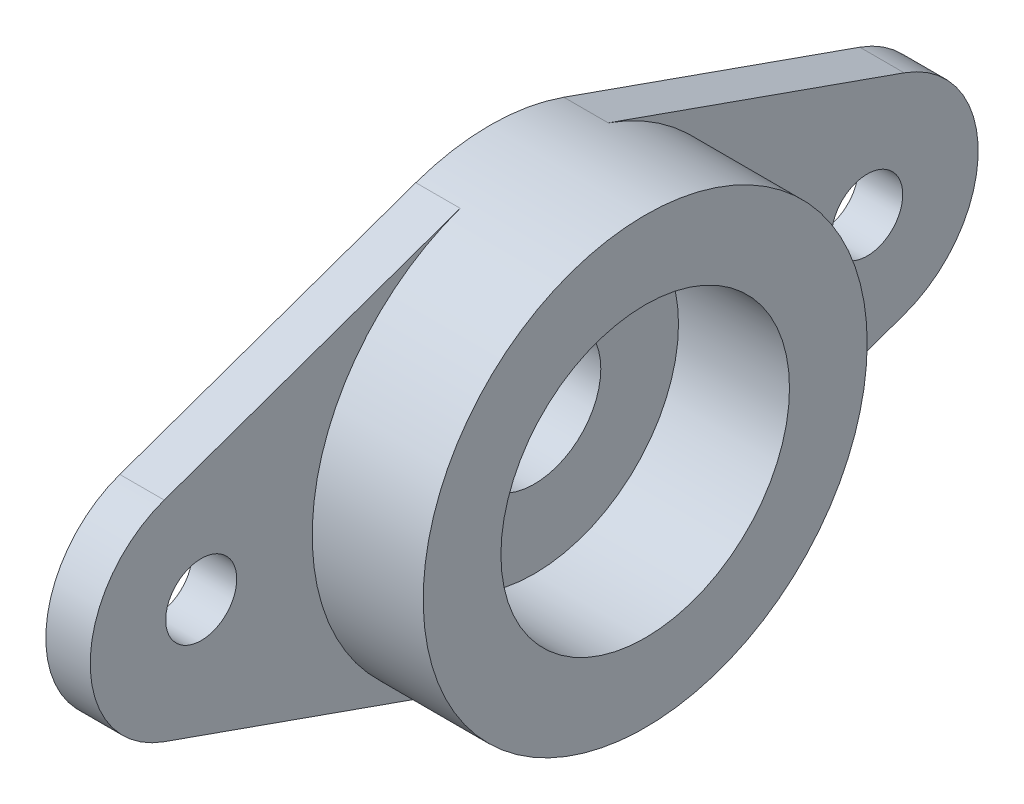
ISO-10303-21;
HEADER;
FILE_DESCRIPTION(('STEP AP214'),'2;1');
FILE_NAME('part.step','',(''),(''),'','','');
FILE_SCHEMA(('AUTOMOTIVE_DESIGN { 1 0 10303 214 1 1 1 1 }'));
ENDSEC;
DATA;
#1=APPLICATION_CONTEXT('core data for automotive mechanical design processes');
#2=APPLICATION_PROTOCOL_DEFINITION('international standard','automotive_design',2000,#1);
#3=PRODUCT_CONTEXT('',#1,'mechanical');
#4=PRODUCT('Part','Part','',(#3));
#5=PRODUCT_RELATED_PRODUCT_CATEGORY('part','',(#4));
#6=PRODUCT_DEFINITION_FORMATION('','',#4);
#7=PRODUCT_DEFINITION_CONTEXT('part definition',#1,'design');
#8=PRODUCT_DEFINITION('design','',#6,#7);
#9=PRODUCT_DEFINITION_SHAPE('','',#8);
#10=(LENGTH_UNIT() NAMED_UNIT(*) SI_UNIT(.MILLI.,.METRE.));
#11=(NAMED_UNIT(*) PLANE_ANGLE_UNIT() SI_UNIT($,.RADIAN.));
#12=(NAMED_UNIT(*) SI_UNIT($,.STERADIAN.) SOLID_ANGLE_UNIT());
#13=UNCERTAINTY_MEASURE_WITH_UNIT(LENGTH_MEASURE(1.E-05),#10,'distance_accuracy_value','');
#14=(GEOMETRIC_REPRESENTATION_CONTEXT(3) GLOBAL_UNCERTAINTY_ASSIGNED_CONTEXT((#13)) GLOBAL_UNIT_ASSIGNED_CONTEXT((#10,
#11,#12)) REPRESENTATION_CONTEXT('',''));
#15=CARTESIAN_POINT('',(0.,0.,0.));
#16=DIRECTION('',(0.,0.,1.));
#17=DIRECTION('',(1.,0.,0.));
#18=AXIS2_PLACEMENT_3D('',#15,#16,#17);
#19=CARTESIAN_POINT('',(40.2842712474619,0.,0.));
#20=DIRECTION('',(-1.,0.,0.));
#21=DIRECTION('',(0.,0.,1.));
#22=AXIS2_PLACEMENT_3D('',#19,#20,#21);
#23=CYLINDRICAL_SURFACE('',#22,10.);
#24=CARTESIAN_POINT('',(7.,0.,0.));
#25=DIRECTION('',(1.,0.,0.));
#26=DIRECTION('',(0.,0.,-1.));
#27=AXIS2_PLACEMENT_3D('',#24,#25,#26);
#28=CIRCLE('',#27,10.);
#29=CARTESIAN_POINT('',(7.,0.,-10.));
#30=VERTEX_POINT('',#29);
#31=EDGE_CURVE('E128',#30,#30,#28,.F.);
#32=ORIENTED_EDGE('',*,*,#31,.T.);
#33=EDGE_LOOP('',(#32));
#34=FACE_BOUND('',#33,.T.);
#35=CARTESIAN_POINT('',(0.,0.,0.));
#36=DIRECTION('',(1.,0.,0.));
#37=DIRECTION('',(0.,0.,-1.));
#38=AXIS2_PLACEMENT_3D('',#35,#36,#37);
#39=CIRCLE('',#38,10.);
#40=CARTESIAN_POINT('',(0.,-9.42809041582064,-3.33333333333333));
#41=VERTEX_POINT('',#40);
#42=CARTESIAN_POINT('',(0.,-9.42809041582064,3.33333333333333));
#43=VERTEX_POINT('',#42);
#44=EDGE_CURVE('E186',#41,#43,#39,.F.);
#45=ORIENTED_EDGE('',*,*,#44,.F.);
#46=DIRECTION('',(-1.,0.,0.));
#47=VECTOR('',#46,1.);
#48=CARTESIAN_POINT('',(2.,-9.42809041582064,-3.33333333333333));
#49=LINE('',#48,#47);
#50=CARTESIAN_POINT('',(2.,-9.42809041582064,-3.33333333333333));
#51=VERTEX_POINT('',#50);
#52=EDGE_CURVE('E156',#51,#41,#49,.T.);
#53=ORIENTED_EDGE('',*,*,#52,.F.);
#54=CARTESIAN_POINT('',(2.,0.,0.));
#55=DIRECTION('',(1.,0.,0.));
#56=DIRECTION('',(0.,0.,-1.));
#57=AXIS2_PLACEMENT_3D('',#54,#55,#56);
#58=CIRCLE('',#57,10.);
#59=CARTESIAN_POINT('',(2.,9.42809041582064,-3.33333333333333));
#60=VERTEX_POINT('',#59);
#61=EDGE_CURVE('E142',#60,#51,#58,.F.);
#62=ORIENTED_EDGE('',*,*,#61,.F.);
#63=DIRECTION('',(-1.,0.,0.));
#64=VECTOR('',#63,1.);
#65=CARTESIAN_POINT('',(2.,9.42809041582064,-3.33333333333333));
#66=LINE('',#65,#64);
#67=CARTESIAN_POINT('',(0.,9.42809041582064,-3.33333333333333));
#68=VERTEX_POINT('',#67);
#69=EDGE_CURVE('E171',#60,#68,#66,.T.);
#70=ORIENTED_EDGE('',*,*,#69,.T.);
#71=CARTESIAN_POINT('',(0.,9.42809041582063,3.33333333333333));
#72=VERTEX_POINT('',#71);
#73=EDGE_CURVE('E182',#72,#68,#39,.F.);
#74=ORIENTED_EDGE('',*,*,#73,.F.);
#75=DIRECTION('',(-1.,0.,0.));
#76=VECTOR('',#75,1.);
#77=CARTESIAN_POINT('',(2.,9.42809041582064,3.33333333333333));
#78=LINE('',#77,#76);
#79=CARTESIAN_POINT('',(2.,9.42809041582064,3.33333333333333));
#80=VERTEX_POINT('',#79);
#81=EDGE_CURVE('E221',#80,#72,#78,.T.);
#82=ORIENTED_EDGE('',*,*,#81,.F.);
#83=CARTESIAN_POINT('',(2.,0.,0.));
#84=DIRECTION('',(1.,0.,0.));
#85=DIRECTION('',(0.,0.,-1.));
#86=AXIS2_PLACEMENT_3D('',#83,#84,#85);
#87=CIRCLE('',#86,10.);
#88=CARTESIAN_POINT('',(2.,-9.42809041582064,3.33333333333333));
#89=VERTEX_POINT('',#88);
#90=EDGE_CURVE('E201',#89,#80,#87,.F.);
#91=ORIENTED_EDGE('',*,*,#90,.F.);
#92=DIRECTION('',(-1.,0.,0.));
#93=VECTOR('',#92,1.);
#94=CARTESIAN_POINT('',(2.,-9.42809041582064,3.33333333333333));
#95=LINE('',#94,#93);
#96=EDGE_CURVE('E58',#89,#43,#95,.T.);
#97=ORIENTED_EDGE('',*,*,#96,.T.);
#98=EDGE_LOOP('',(#45,#53,#62,#70,#74,#82,#91,#97));
#99=FACE_BOUND('',#98,.T.);
#100=ADVANCED_FACE('F49',(#34,#99),#23,.T.);
#101=CARTESIAN_POINT('',(2.,0.,15.));
#102=DIRECTION('',(-1.,0.,0.));
#103=DIRECTION('',(0.,0.,1.));
#104=AXIS2_PLACEMENT_3D('',#101,#102,#103);
#105=CYLINDRICAL_SURFACE('',#104,5.);
#106=CARTESIAN_POINT('',(0.,0.,15.));
#107=DIRECTION('',(1.,0.,0.));
#108=DIRECTION('',(0.,0.,-1.));
#109=AXIS2_PLACEMENT_3D('',#106,#107,#108);
#110=CIRCLE('',#109,5.);
#111=CARTESIAN_POINT('',(0.,-4.71404520791032,16.6666666666667));
#112=VERTEX_POINT('',#111);
#113=CARTESIAN_POINT('',(0.,4.71404520791032,16.6666666666667));
#114=VERTEX_POINT('',#113);
#115=EDGE_CURVE('E210',#112,#114,#110,.F.);
#116=ORIENTED_EDGE('',*,*,#115,.F.);
#117=DIRECTION('',(-1.,0.,0.));
#118=VECTOR('',#117,1.);
#119=CARTESIAN_POINT('',(2.,-4.71404520791032,16.6666666666667));
#120=LINE('',#119,#118);
#121=CARTESIAN_POINT('',(2.,-4.71404520791032,16.6666666666667));
#122=VERTEX_POINT('',#121);
#123=EDGE_CURVE('E12',#122,#112,#120,.T.);
#124=ORIENTED_EDGE('',*,*,#123,.F.);
#125=CARTESIAN_POINT('',(2.,0.,15.));
#126=DIRECTION('',(1.,0.,0.));
#127=DIRECTION('',(0.,0.,-1.));
#128=AXIS2_PLACEMENT_3D('',#125,#126,#127);
#129=CIRCLE('',#128,5.);
#130=CARTESIAN_POINT('',(2.,4.71404520791032,16.6666666666667));
#131=VERTEX_POINT('',#130);
#132=EDGE_CURVE('E194',#122,#131,#129,.F.);
#133=ORIENTED_EDGE('',*,*,#132,.T.);
#134=DIRECTION('',(-1.,0.,0.));
#135=VECTOR('',#134,1.);
#136=CARTESIAN_POINT('',(2.,4.71404520791032,16.6666666666667));
#137=LINE('',#136,#135);
#138=EDGE_CURVE('E74',#131,#114,#137,.T.);
#139=ORIENTED_EDGE('',*,*,#138,.T.);
#140=EDGE_LOOP('',(#116,#124,#133,#139));
#141=FACE_BOUND('',#140,.T.);
#142=ADVANCED_FACE('F237',(#141),#105,.T.);
#143=CARTESIAN_POINT('',(2.,-9.42809041582063,3.33333333333333));
#144=DIRECTION('',(0.,0.942809041582063,-0.333333333333333));
#145=DIRECTION('',(0.,0.333333333333333,0.942809041582063));
#146=AXIS2_PLACEMENT_3D('',#143,#144,#145);
#147=PLANE('',#146);
#148=DIRECTION('',(0.,-0.333333333333333,-0.942809041582063));
#149=VECTOR('',#148,1.);
#150=CARTESIAN_POINT('',(0.,-9.42809041582063,3.33333333333333));
#151=LINE('',#150,#149);
#152=EDGE_CURVE('E213',#112,#43,#151,.T.);
#153=ORIENTED_EDGE('',*,*,#152,.T.);
#154=ORIENTED_EDGE('',*,*,#96,.F.);
#155=DIRECTION('',(0.,-0.333333333333333,-0.942809041582063));
#156=VECTOR('',#155,1.);
#157=CARTESIAN_POINT('',(2.,-9.42809041582063,3.33333333333333));
#158=LINE('',#157,#156);
#159=EDGE_CURVE('E198',#122,#89,#158,.T.);
#160=ORIENTED_EDGE('',*,*,#159,.F.);
#161=ORIENTED_EDGE('',*,*,#123,.T.);
#162=EDGE_LOOP('',(#153,#154,#160,#161));
#163=FACE_BOUND('',#162,.T.);
#164=ADVANCED_FACE('F232',(#163),#147,.F.);
#165=CARTESIAN_POINT('',(2.,0.,15.));
#166=DIRECTION('',(-1.,0.,0.));
#167=DIRECTION('',(0.,0.,1.));
#168=AXIS2_PLACEMENT_3D('',#165,#166,#167);
#169=CYLINDRICAL_SURFACE('',#168,1.6);
#170=CARTESIAN_POINT('',(2.,0.,15.));
#171=DIRECTION('',(1.,0.,0.));
#172=DIRECTION('',(0.,0.,-1.));
#173=AXIS2_PLACEMENT_3D('',#170,#171,#172);
#174=CIRCLE('',#173,1.6);
#175=CARTESIAN_POINT('',(2.,0.,13.4));
#176=VERTEX_POINT('',#175);
#177=EDGE_CURVE('E190',#176,#176,#174,.T.);
#178=ORIENTED_EDGE('',*,*,#177,.T.);
#179=EDGE_LOOP('',(#178));
#180=FACE_BOUND('',#179,.T.);
#181=CARTESIAN_POINT('',(0.,0.,15.));
#182=DIRECTION('',(1.,0.,0.));
#183=DIRECTION('',(0.,0.,-1.));
#184=AXIS2_PLACEMENT_3D('',#181,#182,#183);
#185=CIRCLE('',#184,1.6);
#186=CARTESIAN_POINT('',(0.,0.,13.4));
#187=VERTEX_POINT('',#186);
#188=EDGE_CURVE('E181',#187,#187,#185,.T.);
#189=ORIENTED_EDGE('',*,*,#188,.F.);
#190=EDGE_LOOP('',(#189));
#191=FACE_BOUND('',#190,.T.);
#192=ADVANCED_FACE('F51',(#180,#191),#169,.F.);
#193=CARTESIAN_POINT('',(2.,9.42809041582064,3.33333333333333));
#194=DIRECTION('',(0.,0.942809041582063,0.333333333333333));
#195=DIRECTION('',(0.,-0.333333333333333,0.942809041582063));
#196=AXIS2_PLACEMENT_3D('',#193,#194,#195);
#197=PLANE('',#196);
#198=DIRECTION('',(0.,0.333333333333333,-0.942809041582063));
#199=VECTOR('',#198,1.);
#200=CARTESIAN_POINT('',(0.,9.42809041582064,3.33333333333333));
#201=LINE('',#200,#199);
#202=EDGE_CURVE('E195',#114,#72,#201,.T.);
#203=ORIENTED_EDGE('',*,*,#202,.F.);
#204=ORIENTED_EDGE('',*,*,#138,.F.);
#205=DIRECTION('',(0.,0.333333333333333,-0.942809041582063));
#206=VECTOR('',#205,1.);
#207=CARTESIAN_POINT('',(2.,9.42809041582064,3.33333333333333));
#208=LINE('',#207,#206);
#209=EDGE_CURVE('E204',#131,#80,#208,.T.);
#210=ORIENTED_EDGE('',*,*,#209,.T.);
#211=ORIENTED_EDGE('',*,*,#81,.T.);
#212=EDGE_LOOP('',(#203,#204,#210,#211));
#213=FACE_BOUND('',#212,.T.);
#214=ADVANCED_FACE('F248',(#213),#197,.T.);
#215=CARTESIAN_POINT('',(2.,0.,0.));
#216=DIRECTION('',(1.,0.,0.));
#217=DIRECTION('',(0.,0.,-1.));
#218=AXIS2_PLACEMENT_3D('',#215,#216,#217);
#219=PLANE('',#218);
#220=ORIENTED_EDGE('',*,*,#177,.F.);
#221=EDGE_LOOP('',(#220));
#222=FACE_BOUND('',#221,.T.);
#223=ORIENTED_EDGE('',*,*,#132,.F.);
#224=ORIENTED_EDGE('',*,*,#159,.T.);
#225=ORIENTED_EDGE('',*,*,#90,.T.);
#226=ORIENTED_EDGE('',*,*,#209,.F.);
#227=EDGE_LOOP('',(#223,#224,#225,#226));
#228=FACE_BOUND('',#227,.T.);
#229=ADVANCED_FACE('F251',(#222,#228),#219,.T.);
#230=CARTESIAN_POINT('',(0.,0.,0.));
#231=DIRECTION('',(1.,0.,0.));
#232=DIRECTION('',(0.,0.,-1.));
#233=AXIS2_PLACEMENT_3D('',#230,#231,#232);
#234=PLANE('',#233);
#235=ORIENTED_EDGE('',*,*,#188,.T.);
#236=EDGE_LOOP('',(#235));
#237=FACE_BOUND('',#236,.T.);
#238=ORIENTED_EDGE('',*,*,#115,.T.);
#239=ORIENTED_EDGE('',*,*,#202,.T.);
#240=ORIENTED_EDGE('',*,*,#73,.T.);
#241=DIRECTION('',(0.,0.333333333333333,0.942809041582063));
#242=VECTOR('',#241,1.);
#243=CARTESIAN_POINT('',(0.,9.42809041582064,-3.33333333333333));
#244=LINE('',#243,#242);
#245=CARTESIAN_POINT('',(0.,4.71404520791032,-16.6666666666667));
#246=VERTEX_POINT('',#245);
#247=EDGE_CURVE('E148',#246,#68,#244,.T.);
#248=ORIENTED_EDGE('',*,*,#247,.F.);
#249=CARTESIAN_POINT('',(0.,0.,-15.));
#250=DIRECTION('',(1.,0.,0.));
#251=DIRECTION('',(0.,0.,-1.));
#252=AXIS2_PLACEMENT_3D('',#249,#250,#251);
#253=CIRCLE('',#252,5.);
#254=CARTESIAN_POINT('',(0.,-4.71404520791032,-16.6666666666667));
#255=VERTEX_POINT('',#254);
#256=EDGE_CURVE('E164',#255,#246,#253,.T.);
#257=ORIENTED_EDGE('',*,*,#256,.F.);
#258=DIRECTION('',(0.,-0.333333333333333,0.942809041582063));
#259=VECTOR('',#258,1.);
#260=CARTESIAN_POINT('',(0.,-9.42809041582063,-3.33333333333333));
#261=LINE('',#260,#259);
#262=EDGE_CURVE('E65',#255,#41,#261,.T.);
#263=ORIENTED_EDGE('',*,*,#262,.T.);
#264=ORIENTED_EDGE('',*,*,#44,.T.);
#265=ORIENTED_EDGE('',*,*,#152,.F.);
#266=EDGE_LOOP('',(#238,#239,#240,#248,#257,#263,#264,#265));
#267=FACE_BOUND('',#266,.T.);
#268=CARTESIAN_POINT('',(0.,0.,-15.));
#269=DIRECTION('',(1.,0.,0.));
#270=DIRECTION('',(0.,0.,-1.));
#271=AXIS2_PLACEMENT_3D('',#268,#269,#270);
#272=CIRCLE('',#271,1.6);
#273=CARTESIAN_POINT('',(0.,0.,-16.6));
#274=VERTEX_POINT('',#273);
#275=EDGE_CURVE('E157',#274,#274,#272,.F.);
#276=ORIENTED_EDGE('',*,*,#275,.F.);
#277=EDGE_LOOP('',(#276));
#278=FACE_BOUND('',#277,.T.);
#279=CARTESIAN_POINT('',(0.,0.,0.));
#280=DIRECTION('',(1.,0.,0.));
#281=DIRECTION('',(0.,0.,-1.));
#282=AXIS2_PLACEMENT_3D('',#279,#280,#281);
#283=CIRCLE('',#282,3.);
#284=CARTESIAN_POINT('',(0.,0.,-3.));
#285=VERTEX_POINT('',#284);
#286=EDGE_CURVE('E299',#285,#285,#283,.T.);
#287=ORIENTED_EDGE('',*,*,#286,.T.);
#288=EDGE_LOOP('',(#287));
#289=FACE_BOUND('',#288,.T.);
#290=ADVANCED_FACE('F235',(#237,#267,#278,#289),#234,.F.);
#291=CARTESIAN_POINT('',(40.2842712474619,0.,0.));
#292=DIRECTION('',(-1.,0.,0.));
#293=DIRECTION('',(0.,0.,1.));
#294=AXIS2_PLACEMENT_3D('',#291,#292,#293);
#295=CYLINDRICAL_SURFACE('',#294,6.5);
#296=CARTESIAN_POINT('',(2.,0.,0.));
#297=DIRECTION('',(1.,0.,0.));
#298=DIRECTION('',(0.,0.,-1.));
#299=AXIS2_PLACEMENT_3D('',#296,#297,#298);
#300=CIRCLE('',#299,6.5);
#301=CARTESIAN_POINT('',(2.,0.,-6.5));
#302=VERTEX_POINT('',#301);
#303=EDGE_CURVE('E161',#302,#302,#300,.F.);
#304=ORIENTED_EDGE('',*,*,#303,.T.);
#305=EDGE_LOOP('',(#304));
#306=FACE_BOUND('',#305,.T.);
#307=CARTESIAN_POINT('',(7.,0.,0.));
#308=DIRECTION('',(1.,0.,0.));
#309=DIRECTION('',(0.,0.,-1.));
#310=AXIS2_PLACEMENT_3D('',#307,#308,#309);
#311=CIRCLE('',#310,6.5);
#312=CARTESIAN_POINT('',(7.,0.,-6.5));
#313=VERTEX_POINT('',#312);
#314=EDGE_CURVE('E177',#313,#313,#311,.F.);
#315=ORIENTED_EDGE('',*,*,#314,.F.);
#316=EDGE_LOOP('',(#315));
#317=FACE_BOUND('',#316,.T.);
#318=ADVANCED_FACE('F254',(#306,#317),#295,.F.);
#319=CARTESIAN_POINT('',(7.,0.,0.));
#320=DIRECTION('',(1.,0.,0.));
#321=DIRECTION('',(0.,0.,-1.));
#322=AXIS2_PLACEMENT_3D('',#319,#320,#321);
#323=PLANE('',#322);
#324=ORIENTED_EDGE('',*,*,#31,.F.);
#325=EDGE_LOOP('',(#324));
#326=FACE_BOUND('',#325,.T.);
#327=ORIENTED_EDGE('',*,*,#314,.T.);
#328=EDGE_LOOP('',(#327));
#329=FACE_BOUND('',#328,.T.);
#330=ADVANCED_FACE('F260',(#326,#329),#323,.T.);
#331=CARTESIAN_POINT('',(2.,-9.42809041582063,-3.33333333333333));
#332=DIRECTION('',(0.,-0.942809041582063,-0.333333333333333));
#333=DIRECTION('',(0.,0.333333333333333,-0.942809041582063));
#334=AXIS2_PLACEMENT_3D('',#331,#332,#333);
#335=PLANE('',#334);
#336=ORIENTED_EDGE('',*,*,#262,.F.);
#337=DIRECTION('',(-1.,0.,0.));
#338=VECTOR('',#337,1.);
#339=CARTESIAN_POINT('',(2.,-4.71404520791032,-16.6666666666667));
#340=LINE('',#339,#338);
#341=CARTESIAN_POINT('',(2.,-4.71404520791032,-16.6666666666667));
#342=VERTEX_POINT('',#341);
#343=EDGE_CURVE('E119',#342,#255,#340,.T.);
#344=ORIENTED_EDGE('',*,*,#343,.F.);
#345=DIRECTION('',(0.,-0.333333333333333,0.942809041582063));
#346=VECTOR('',#345,1.);
#347=CARTESIAN_POINT('',(2.,-9.42809041582063,-3.33333333333333));
#348=LINE('',#347,#346);
#349=EDGE_CURVE('E123',#342,#51,#348,.T.);
#350=ORIENTED_EDGE('',*,*,#349,.T.);
#351=ORIENTED_EDGE('',*,*,#52,.T.);
#352=EDGE_LOOP('',(#336,#344,#350,#351));
#353=FACE_BOUND('',#352,.T.);
#354=ADVANCED_FACE('F121',(#353),#335,.T.);
#355=CARTESIAN_POINT('',(2.,0.,-15.));
#356=DIRECTION('',(-1.,0.,0.));
#357=DIRECTION('',(0.,0.,1.));
#358=AXIS2_PLACEMENT_3D('',#355,#356,#357);
#359=CYLINDRICAL_SURFACE('',#358,5.);
#360=ORIENTED_EDGE('',*,*,#256,.T.);
#361=DIRECTION('',(-1.,0.,0.));
#362=VECTOR('',#361,1.);
#363=CARTESIAN_POINT('',(2.,4.71404520791032,-16.6666666666667));
#364=LINE('',#363,#362);
#365=CARTESIAN_POINT('',(2.,4.71404520791032,-16.6666666666667));
#366=VERTEX_POINT('',#365);
#367=EDGE_CURVE('E129',#366,#246,#364,.T.);
#368=ORIENTED_EDGE('',*,*,#367,.F.);
#369=CARTESIAN_POINT('',(2.,0.,-15.));
#370=DIRECTION('',(1.,0.,0.));
#371=DIRECTION('',(0.,0.,-1.));
#372=AXIS2_PLACEMENT_3D('',#369,#370,#371);
#373=CIRCLE('',#372,5.);
#374=EDGE_CURVE('E133',#342,#366,#373,.T.);
#375=ORIENTED_EDGE('',*,*,#374,.F.);
#376=ORIENTED_EDGE('',*,*,#343,.T.);
#377=EDGE_LOOP('',(#360,#368,#375,#376));
#378=FACE_BOUND('',#377,.T.);
#379=ADVANCED_FACE('F134',(#378),#359,.T.);
#380=CARTESIAN_POINT('',(2.,9.42809041582064,-3.33333333333333));
#381=DIRECTION('',(0.,-0.942809041582063,0.333333333333333));
#382=DIRECTION('',(0.,-0.333333333333333,-0.942809041582063));
#383=AXIS2_PLACEMENT_3D('',#380,#381,#382);
#384=PLANE('',#383);
#385=ORIENTED_EDGE('',*,*,#247,.T.);
#386=ORIENTED_EDGE('',*,*,#69,.F.);
#387=DIRECTION('',(0.,0.333333333333333,0.942809041582063));
#388=VECTOR('',#387,1.);
#389=CARTESIAN_POINT('',(2.,9.42809041582064,-3.33333333333333));
#390=LINE('',#389,#388);
#391=EDGE_CURVE('E138',#366,#60,#390,.T.);
#392=ORIENTED_EDGE('',*,*,#391,.F.);
#393=ORIENTED_EDGE('',*,*,#367,.T.);
#394=EDGE_LOOP('',(#385,#386,#392,#393));
#395=FACE_BOUND('',#394,.T.);
#396=ADVANCED_FACE('F269',(#395),#384,.F.);
#397=CARTESIAN_POINT('',(2.,0.,-15.));
#398=DIRECTION('',(-1.,0.,0.));
#399=DIRECTION('',(0.,0.,1.));
#400=AXIS2_PLACEMENT_3D('',#397,#398,#399);
#401=CYLINDRICAL_SURFACE('',#400,1.6);
#402=CARTESIAN_POINT('',(2.,0.,-15.));
#403=DIRECTION('',(1.,0.,0.));
#404=DIRECTION('',(0.,0.,-1.));
#405=AXIS2_PLACEMENT_3D('',#402,#403,#404);
#406=CIRCLE('',#405,1.6);
#407=CARTESIAN_POINT('',(2.,0.,-16.6));
#408=VERTEX_POINT('',#407);
#409=EDGE_CURVE('E144',#408,#408,#406,.F.);
#410=ORIENTED_EDGE('',*,*,#409,.F.);
#411=EDGE_LOOP('',(#410));
#412=FACE_BOUND('',#411,.T.);
#413=ORIENTED_EDGE('',*,*,#275,.T.);
#414=EDGE_LOOP('',(#413));
#415=FACE_BOUND('',#414,.T.);
#416=ADVANCED_FACE('F266',(#412,#415),#401,.F.);
#417=CARTESIAN_POINT('',(2.,0.,0.));
#418=DIRECTION('',(1.,0.,0.));
#419=DIRECTION('',(0.,0.,-1.));
#420=AXIS2_PLACEMENT_3D('',#417,#418,#419);
#421=PLANE('',#420);
#422=ORIENTED_EDGE('',*,*,#409,.T.);
#423=EDGE_LOOP('',(#422));
#424=FACE_BOUND('',#423,.T.);
#425=ORIENTED_EDGE('',*,*,#349,.F.);
#426=ORIENTED_EDGE('',*,*,#374,.T.);
#427=ORIENTED_EDGE('',*,*,#391,.T.);
#428=ORIENTED_EDGE('',*,*,#61,.T.);
#429=EDGE_LOOP('',(#425,#426,#427,#428));
#430=FACE_BOUND('',#429,.T.);
#431=ADVANCED_FACE('F140',(#424,#430),#421,.T.);
#432=CARTESIAN_POINT('',(2.,0.,0.));
#433=DIRECTION('',(-1.,0.,0.));
#434=DIRECTION('',(0.,0.,1.));
#435=AXIS2_PLACEMENT_3D('',#432,#433,#434);
#436=CYLINDRICAL_SURFACE('',#435,3.);
#437=CARTESIAN_POINT('',(2.,0.,0.));
#438=DIRECTION('',(1.,0.,0.));
#439=DIRECTION('',(0.,0.,-1.));
#440=AXIS2_PLACEMENT_3D('',#437,#438,#439);
#441=CIRCLE('',#440,3.);
#442=CARTESIAN_POINT('',(2.,0.,-3.));
#443=VERTEX_POINT('',#442);
#444=EDGE_CURVE('E293',#443,#443,#441,.T.);
#445=ORIENTED_EDGE('',*,*,#444,.T.);
#446=EDGE_LOOP('',(#445));
#447=FACE_BOUND('',#446,.T.);
#448=ORIENTED_EDGE('',*,*,#286,.F.);
#449=EDGE_LOOP('',(#448));
#450=FACE_BOUND('',#449,.T.);
#451=ADVANCED_FACE('F280',(#447,#450),#436,.F.);
#452=CARTESIAN_POINT('',(2.,0.,0.));
#453=DIRECTION('',(1.,0.,0.));
#454=DIRECTION('',(0.,0.,-1.));
#455=AXIS2_PLACEMENT_3D('',#452,#453,#454);
#456=PLANE('',#455);
#457=ORIENTED_EDGE('',*,*,#444,.F.);
#458=EDGE_LOOP('',(#457));
#459=FACE_BOUND('',#458,.T.);
#460=ORIENTED_EDGE('',*,*,#303,.F.);
#461=EDGE_LOOP('',(#460));
#462=FACE_BOUND('',#461,.T.);
#463=ADVANCED_FACE('F284',(#459,#462),#456,.T.);
#464=CLOSED_SHELL('',(#100,#142,#164,#192,#214,#229,#290,#318,#330,#354,#379,#396,#416,#431,
#451,#463));
#465=MANIFOLD_SOLID_BREP('B2',#464);
#466=ADVANCED_BREP_SHAPE_REPRESENTATION('',(#18,#465),#14);
#467=SHAPE_DEFINITION_REPRESENTATION(#9,#466);
ENDSEC;
END-ISO-10303-21;
